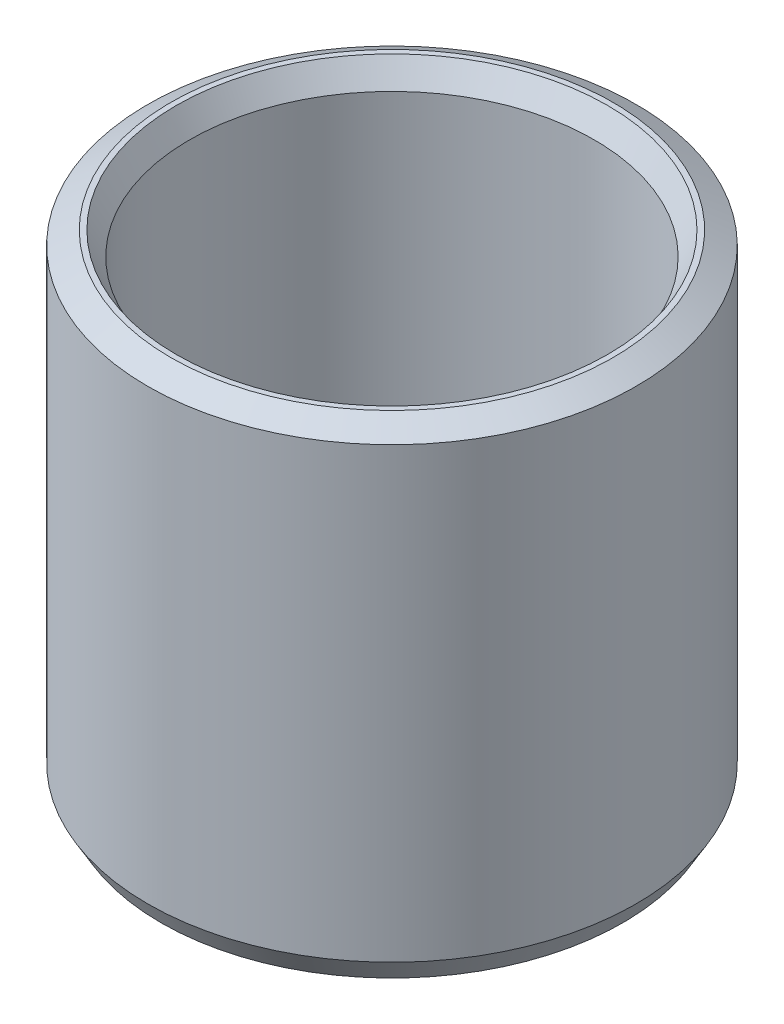
ISO-10303-21;
HEADER;
FILE_DESCRIPTION(('STEP AP214'),'2;1');
FILE_NAME('part.step','',(''),(''),'','','');
FILE_SCHEMA(('AUTOMOTIVE_DESIGN { 1 0 10303 214 1 1 1 1 }'));
ENDSEC;
DATA;
#1=APPLICATION_CONTEXT('core data for automotive mechanical design processes');
#2=APPLICATION_PROTOCOL_DEFINITION('international standard','automotive_design',2000,#1);
#3=PRODUCT_CONTEXT('',#1,'mechanical');
#4=PRODUCT('Part','Part','',(#3));
#5=PRODUCT_RELATED_PRODUCT_CATEGORY('part','',(#4));
#6=PRODUCT_DEFINITION_FORMATION('','',#4);
#7=PRODUCT_DEFINITION_CONTEXT('part definition',#1,'design');
#8=PRODUCT_DEFINITION('design','',#6,#7);
#9=PRODUCT_DEFINITION_SHAPE('','',#8);
#10=(LENGTH_UNIT() NAMED_UNIT(*) SI_UNIT(.MILLI.,.METRE.));
#11=(NAMED_UNIT(*) PLANE_ANGLE_UNIT() SI_UNIT($,.RADIAN.));
#12=(NAMED_UNIT(*) SI_UNIT($,.STERADIAN.) SOLID_ANGLE_UNIT());
#13=UNCERTAINTY_MEASURE_WITH_UNIT(LENGTH_MEASURE(1.E-05),#10,'distance_accuracy_value','');
#14=(GEOMETRIC_REPRESENTATION_CONTEXT(3) GLOBAL_UNCERTAINTY_ASSIGNED_CONTEXT((#13)) GLOBAL_UNIT_ASSIGNED_CONTEXT((#10,
#11,#12)) REPRESENTATION_CONTEXT('',''));
#15=CARTESIAN_POINT('',(0.,0.,0.));
#16=DIRECTION('',(0.,0.,1.));
#17=DIRECTION('',(1.,0.,0.));
#18=AXIS2_PLACEMENT_3D('',#15,#16,#17);
#19=CARTESIAN_POINT('',(0.,64.4994663057111,0.));
#20=DIRECTION('',(0.,-1.,0.));
#21=DIRECTION('',(0.,0.,-1.));
#22=AXIS2_PLACEMENT_3D('',#19,#20,#21);
#23=CYLINDRICAL_SURFACE('',#22,32.5);
#24=CARTESIAN_POINT('',(0.,3.07189015026921,0.));
#25=DIRECTION('',(0.,1.,0.));
#26=DIRECTION('',(0.,0.,1.));
#27=AXIS2_PLACEMENT_3D('',#24,#25,#26);
#28=CIRCLE('',#27,32.5);
#29=CARTESIAN_POINT('',(0.,3.07189015026921,32.5));
#30=VERTEX_POINT('',#29);
#31=EDGE_CURVE('E10',#30,#30,#28,.T.);
#32=ORIENTED_EDGE('',*,*,#31,.T.);
#33=EDGE_LOOP('',(#32));
#34=FACE_BOUND('',#33,.T.);
#35=CARTESIAN_POINT('',(0.,62.7259097005322,0.));
#36=DIRECTION('',(0.,1.,0.));
#37=DIRECTION('',(0.,0.,1.));
#38=AXIS2_PLACEMENT_3D('',#35,#36,#37);
#39=CIRCLE('',#38,32.5);
#40=CARTESIAN_POINT('',(0.,62.7259097005322,32.5));
#41=VERTEX_POINT('',#40);
#42=EDGE_CURVE('E50',#41,#41,#39,.F.);
#43=ORIENTED_EDGE('',*,*,#42,.T.);
#44=EDGE_LOOP('',(#43));
#45=FACE_BOUND('',#44,.T.);
#46=ADVANCED_FACE('F39',(#34,#45),#23,.T.);
#47=CARTESIAN_POINT('',(0.,64.4994663057111,0.));
#48=DIRECTION('',(0.,1.,0.));
#49=DIRECTION('',(0.,0.,1.));
#50=AXIS2_PLACEMENT_3D('',#47,#48,#49);
#51=PLANE('',#50);
#52=CARTESIAN_POINT('',(0.,64.4994663057111,0.));
#53=DIRECTION('',(0.,1.,0.));
#54=DIRECTION('',(0.,0.,1.));
#55=AXIS2_PLACEMENT_3D('',#52,#53,#54);
#56=CIRCLE('',#55,28.7098953420208);
#57=CARTESIAN_POINT('',(0.,64.4994663057111,28.7098953420208));
#58=VERTEX_POINT('',#57);
#59=EDGE_CURVE('E58',#58,#58,#56,.F.);
#60=ORIENTED_EDGE('',*,*,#59,.T.);
#61=EDGE_LOOP('',(#60));
#62=FACE_BOUND('',#61,.T.);
#63=CARTESIAN_POINT('',(0.,64.4994663057111,0.));
#64=DIRECTION('',(0.,1.,0.));
#65=DIRECTION('',(0.,0.,1.));
#66=AXIS2_PLACEMENT_3D('',#63,#64,#65);
#67=CIRCLE('',#66,29.4281098497308);
#68=CARTESIAN_POINT('',(0.,64.4994663057111,29.4281098497308));
#69=VERTEX_POINT('',#68);
#70=EDGE_CURVE('E61',#69,#69,#67,.T.);
#71=ORIENTED_EDGE('',*,*,#70,.T.);
#72=EDGE_LOOP('',(#71));
#73=FACE_BOUND('',#72,.T.);
#74=ADVANCED_FACE('F88',(#62,#73),#51,.T.);
#75=CARTESIAN_POINT('',(0.,0.,0.));
#76=DIRECTION('',(0.,1.,0.));
#77=DIRECTION('',(0.,0.,1.));
#78=AXIS2_PLACEMENT_3D('',#75,#76,#77);
#79=PLANE('',#78);
#80=CARTESIAN_POINT('',(0.,0.,0.));
#81=DIRECTION('',(0.,1.,0.));
#82=DIRECTION('',(0.,0.,1.));
#83=AXIS2_PLACEMENT_3D('',#80,#81,#82);
#84=CIRCLE('',#83,30.0082288871112);
#85=CARTESIAN_POINT('',(0.,0.,30.0082288871112));
#86=VERTEX_POINT('',#85);
#87=EDGE_CURVE('E51',#86,#86,#84,.T.);
#88=ORIENTED_EDGE('',*,*,#87,.T.);
#89=EDGE_LOOP('',(#88));
#90=FACE_BOUND('',#89,.T.);
#91=CARTESIAN_POINT('',(0.,0.,0.));
#92=DIRECTION('',(0.,1.,0.));
#93=DIRECTION('',(0.,0.,1.));
#94=AXIS2_PLACEMENT_3D('',#91,#92,#93);
#95=CIRCLE('',#94,30.7264433948211);
#96=CARTESIAN_POINT('',(0.,0.,30.7264433948211));
#97=VERTEX_POINT('',#96);
#98=EDGE_CURVE('E54',#97,#97,#95,.F.);
#99=ORIENTED_EDGE('',*,*,#98,.T.);
#100=EDGE_LOOP('',(#99));
#101=FACE_BOUND('',#100,.T.);
#102=ADVANCED_FACE('F83',(#90,#101),#79,.F.);
#103=CARTESIAN_POINT('',(0.,64.4994663057111,0.));
#104=DIRECTION('',(0.,-1.,0.));
#105=DIRECTION('',(0.,0.,-1.));
#106=AXIS2_PLACEMENT_3D('',#103,#104,#105);
#107=CYLINDRICAL_SURFACE('',#106,26.936338736842);
#108=CARTESIAN_POINT('',(0.,61.4275761554419,0.));
#109=DIRECTION('',(0.,1.,0.));
#110=DIRECTION('',(0.,0.,1.));
#111=AXIS2_PLACEMENT_3D('',#108,#109,#110);
#112=CIRCLE('',#111,26.936338736842);
#113=CARTESIAN_POINT('',(0.,61.4275761554419,26.936338736842));
#114=VERTEX_POINT('',#113);
#115=EDGE_CURVE('E67',#114,#114,#112,.T.);
#116=ORIENTED_EDGE('',*,*,#115,.T.);
#117=EDGE_LOOP('',(#116));
#118=FACE_BOUND('',#117,.T.);
#119=CARTESIAN_POINT('',(0.,1.77355660517887,0.));
#120=DIRECTION('',(0.,1.,0.));
#121=DIRECTION('',(0.,0.,1.));
#122=AXIS2_PLACEMENT_3D('',#119,#120,#121);
#123=CIRCLE('',#122,26.936338736842);
#124=CARTESIAN_POINT('',(0.,1.77355660517887,26.936338736842));
#125=VERTEX_POINT('',#124);
#126=EDGE_CURVE('E69',#125,#125,#123,.F.);
#127=ORIENTED_EDGE('',*,*,#126,.T.);
#128=EDGE_LOOP('',(#127));
#129=FACE_BOUND('',#128,.T.);
#130=ADVANCED_FACE('F71',(#118,#129),#107,.F.);
#131=CARTESIAN_POINT('',(0.,61.4275761554419,0.));
#132=DIRECTION('',(0.,1.,0.));
#133=DIRECTION('',(0.,0.,1.));
#134=AXIS2_PLACEMENT_3D('',#131,#132,#133);
#135=CONICAL_SURFACE('',#134,26.936338736842,0.523598775598299);
#136=ORIENTED_EDGE('',*,*,#59,.F.);
#137=EDGE_LOOP('',(#136));
#138=FACE_BOUND('',#137,.T.);
#139=ORIENTED_EDGE('',*,*,#115,.F.);
#140=EDGE_LOOP('',(#139));
#141=FACE_BOUND('',#140,.T.);
#142=ADVANCED_FACE('F77',(#138,#141),#135,.F.);
#143=CARTESIAN_POINT('',(0.,0.,0.));
#144=DIRECTION('',(0.,-1.,0.));
#145=DIRECTION('',(0.,0.,-1.));
#146=AXIS2_PLACEMENT_3D('',#143,#144,#145);
#147=CONICAL_SURFACE('',#146,30.0082288871112,1.04719755119659);
#148=ORIENTED_EDGE('',*,*,#126,.F.);
#149=EDGE_LOOP('',(#148));
#150=FACE_BOUND('',#149,.T.);
#151=ORIENTED_EDGE('',*,*,#87,.F.);
#152=EDGE_LOOP('',(#151));
#153=FACE_BOUND('',#152,.T.);
#154=ADVANCED_FACE('F73',(#150,#153),#147,.F.);
#155=CARTESIAN_POINT('',(0.,3.07189015026921,0.));
#156=DIRECTION('',(0.,1.,0.));
#157=DIRECTION('',(0.,0.,1.));
#158=AXIS2_PLACEMENT_3D('',#155,#156,#157);
#159=CONICAL_SURFACE('',#158,32.5,0.523598775598303);
#160=ORIENTED_EDGE('',*,*,#98,.F.);
#161=EDGE_LOOP('',(#160));
#162=FACE_BOUND('',#161,.T.);
#163=ORIENTED_EDGE('',*,*,#31,.F.);
#164=EDGE_LOOP('',(#163));
#165=FACE_BOUND('',#164,.T.);
#166=ADVANCED_FACE('F76',(#162,#165),#159,.T.);
#167=CARTESIAN_POINT('',(0.,64.4994663057111,0.));
#168=DIRECTION('',(0.,-1.,0.));
#169=DIRECTION('',(0.,0.,-1.));
#170=AXIS2_PLACEMENT_3D('',#167,#168,#169);
#171=CONICAL_SURFACE('',#170,29.4281098497308,1.04719755119659);
#172=ORIENTED_EDGE('',*,*,#42,.F.);
#173=EDGE_LOOP('',(#172));
#174=FACE_BOUND('',#173,.T.);
#175=ORIENTED_EDGE('',*,*,#70,.F.);
#176=EDGE_LOOP('',(#175));
#177=FACE_BOUND('',#176,.T.);
#178=ADVANCED_FACE('F45',(#174,#177),#171,.T.);
#179=CLOSED_SHELL('',(#46,#74,#102,#130,#142,#154,#166,#178));
#180=MANIFOLD_SOLID_BREP('B2',#179);
#181=ADVANCED_BREP_SHAPE_REPRESENTATION('',(#18,#180),#14);
#182=SHAPE_DEFINITION_REPRESENTATION(#9,#181);
ENDSEC;
END-ISO-10303-21;
